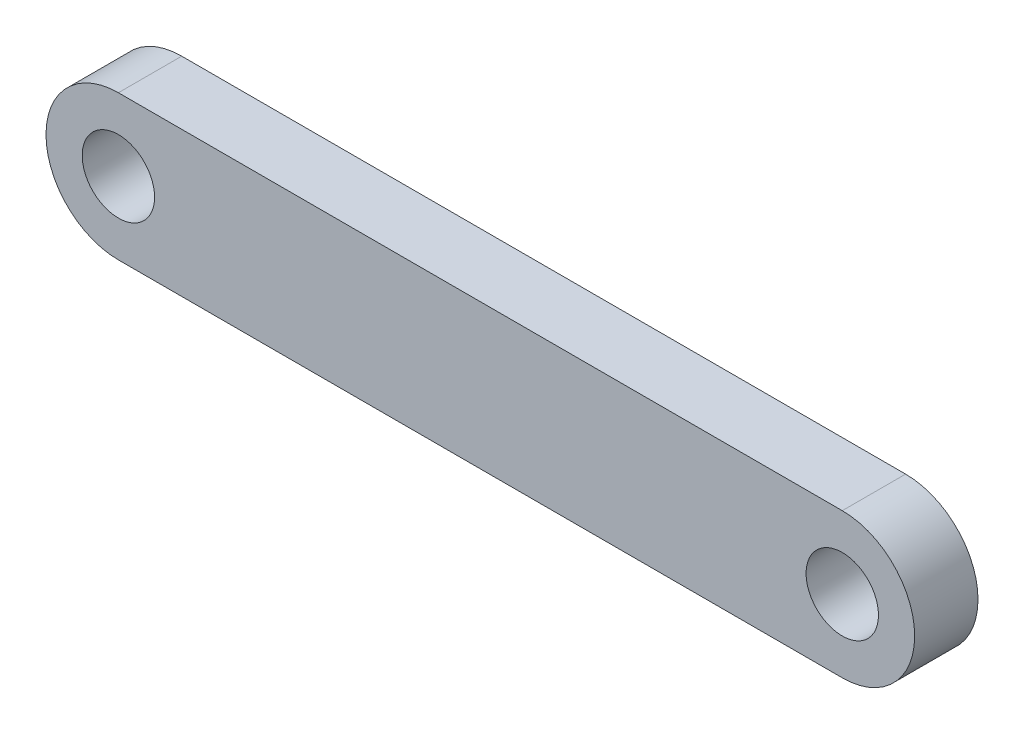
ISO-10303-21;
HEADER;
FILE_DESCRIPTION(('STEP AP214'),'2;1');
FILE_NAME('part.step','',(''),(''),'','','');
FILE_SCHEMA(('AUTOMOTIVE_DESIGN { 1 0 10303 214 1 1 1 1 }'));
ENDSEC;
DATA;
#1=APPLICATION_CONTEXT('core data for automotive mechanical design processes');
#2=APPLICATION_PROTOCOL_DEFINITION('international standard','automotive_design',2000,#1);
#3=PRODUCT_CONTEXT('',#1,'mechanical');
#4=PRODUCT('Part','Part','',(#3));
#5=PRODUCT_RELATED_PRODUCT_CATEGORY('part','',(#4));
#6=PRODUCT_DEFINITION_FORMATION('','',#4);
#7=PRODUCT_DEFINITION_CONTEXT('part definition',#1,'design');
#8=PRODUCT_DEFINITION('design','',#6,#7);
#9=PRODUCT_DEFINITION_SHAPE('','',#8);
#10=(LENGTH_UNIT() NAMED_UNIT(*) SI_UNIT(.MILLI.,.METRE.));
#11=(NAMED_UNIT(*) PLANE_ANGLE_UNIT() SI_UNIT($,.RADIAN.));
#12=(NAMED_UNIT(*) SI_UNIT($,.STERADIAN.) SOLID_ANGLE_UNIT());
#13=UNCERTAINTY_MEASURE_WITH_UNIT(LENGTH_MEASURE(1.E-05),#10,'distance_accuracy_value','');
#14=(GEOMETRIC_REPRESENTATION_CONTEXT(3) GLOBAL_UNCERTAINTY_ASSIGNED_CONTEXT((#13)) GLOBAL_UNIT_ASSIGNED_CONTEXT((#10,
#11,#12)) REPRESENTATION_CONTEXT('',''));
#15=CARTESIAN_POINT('',(0.,0.,0.));
#16=DIRECTION('',(0.,0.,1.));
#17=DIRECTION('',(1.,0.,0.));
#18=AXIS2_PLACEMENT_3D('',#15,#16,#17);
#19=CARTESIAN_POINT('',(0.,0.,8.75));
#20=DIRECTION('',(0.,0.,1.));
#21=DIRECTION('',(1.,0.,0.));
#22=AXIS2_PLACEMENT_3D('',#19,#20,#21);
#23=PLANE('',#22);
#24=CARTESIAN_POINT('',(0.,0.,8.75));
#25=DIRECTION('',(0.,0.,1.));
#26=DIRECTION('',(1.,0.,0.));
#27=AXIS2_PLACEMENT_3D('',#24,#25,#26);
#28=CIRCLE('',#27,5.);
#29=CARTESIAN_POINT('',(5.,0.,8.75));
#30=VERTEX_POINT('',#29);
#31=EDGE_CURVE('E104',#30,#30,#28,.T.);
#32=ORIENTED_EDGE('',*,*,#31,.F.);
#33=EDGE_LOOP('',(#32));
#34=FACE_BOUND('',#33,.T.);
#35=CARTESIAN_POINT('',(0.,0.,8.75));
#36=DIRECTION('',(0.,0.,1.));
#37=DIRECTION('',(1.,0.,0.));
#38=AXIS2_PLACEMENT_3D('',#35,#36,#37);
#39=CIRCLE('',#38,10.);
#40=CARTESIAN_POINT('',(0.,10.,8.75));
#41=VERTEX_POINT('',#40);
#42=CARTESIAN_POINT('',(0.,-10.,8.75));
#43=VERTEX_POINT('',#42);
#44=EDGE_CURVE('E89',#41,#43,#39,.T.);
#45=ORIENTED_EDGE('',*,*,#44,.T.);
#46=DIRECTION('',(1.,0.,0.));
#47=VECTOR('',#46,1.);
#48=CARTESIAN_POINT('',(0.,-10.,8.75));
#49=LINE('',#48,#47);
#50=CARTESIAN_POINT('',(100.,-10.,8.75));
#51=VERTEX_POINT('',#50);
#52=EDGE_CURVE('E84',#43,#51,#49,.T.);
#53=ORIENTED_EDGE('',*,*,#52,.T.);
#54=CARTESIAN_POINT('',(100.,0.,8.75));
#55=DIRECTION('',(0.,0.,1.));
#56=DIRECTION('',(1.,0.,0.));
#57=AXIS2_PLACEMENT_3D('',#54,#55,#56);
#58=CIRCLE('',#57,10.);
#59=CARTESIAN_POINT('',(100.,10.,8.75));
#60=VERTEX_POINT('',#59);
#61=EDGE_CURVE('E87',#51,#60,#58,.T.);
#62=ORIENTED_EDGE('',*,*,#61,.T.);
#63=DIRECTION('',(-1.,0.,0.));
#64=VECTOR('',#63,1.);
#65=CARTESIAN_POINT('',(0.,10.,8.75));
#66=LINE('',#65,#64);
#67=EDGE_CURVE('E54',#60,#41,#66,.T.);
#68=ORIENTED_EDGE('',*,*,#67,.T.);
#69=EDGE_LOOP('',(#45,#53,#62,#68));
#70=FACE_BOUND('',#69,.T.);
#71=CARTESIAN_POINT('',(100.,0.,8.75));
#72=DIRECTION('',(0.,0.,1.));
#73=DIRECTION('',(1.,0.,0.));
#74=AXIS2_PLACEMENT_3D('',#71,#72,#73);
#75=CIRCLE('',#74,4.99999999999999);
#76=CARTESIAN_POINT('',(105.,0.,8.75));
#77=VERTEX_POINT('',#76);
#78=EDGE_CURVE('E119',#77,#77,#75,.T.);
#79=ORIENTED_EDGE('',*,*,#78,.F.);
#80=EDGE_LOOP('',(#79));
#81=FACE_BOUND('',#80,.T.);
#82=ADVANCED_FACE('F37',(#34,#70,#81),#23,.T.);
#83=CARTESIAN_POINT('',(0.,0.,0.));
#84=DIRECTION('',(0.,0.,1.));
#85=DIRECTION('',(1.,0.,0.));
#86=AXIS2_PLACEMENT_3D('',#83,#84,#85);
#87=PLANE('',#86);
#88=CARTESIAN_POINT('',(0.,0.,0.));
#89=DIRECTION('',(0.,0.,1.));
#90=DIRECTION('',(1.,0.,0.));
#91=AXIS2_PLACEMENT_3D('',#88,#89,#90);
#92=CIRCLE('',#91,10.);
#93=CARTESIAN_POINT('',(0.,10.,0.));
#94=VERTEX_POINT('',#93);
#95=CARTESIAN_POINT('',(0.,-10.,0.));
#96=VERTEX_POINT('',#95);
#97=EDGE_CURVE('E101',#94,#96,#92,.T.);
#98=ORIENTED_EDGE('',*,*,#97,.F.);
#99=DIRECTION('',(-1.,0.,0.));
#100=VECTOR('',#99,1.);
#101=CARTESIAN_POINT('',(0.,10.,0.));
#102=LINE('',#101,#100);
#103=CARTESIAN_POINT('',(100.,10.,0.));
#104=VERTEX_POINT('',#103);
#105=EDGE_CURVE('E77',#104,#94,#102,.T.);
#106=ORIENTED_EDGE('',*,*,#105,.F.);
#107=CARTESIAN_POINT('',(100.,0.,0.));
#108=DIRECTION('',(0.,0.,1.));
#109=DIRECTION('',(1.,0.,0.));
#110=AXIS2_PLACEMENT_3D('',#107,#108,#109);
#111=CIRCLE('',#110,10.);
#112=CARTESIAN_POINT('',(100.,-10.,0.));
#113=VERTEX_POINT('',#112);
#114=EDGE_CURVE('E71',#113,#104,#111,.T.);
#115=ORIENTED_EDGE('',*,*,#114,.F.);
#116=DIRECTION('',(1.,0.,0.));
#117=VECTOR('',#116,1.);
#118=CARTESIAN_POINT('',(0.,-10.,0.));
#119=LINE('',#118,#117);
#120=EDGE_CURVE('E93',#96,#113,#119,.T.);
#121=ORIENTED_EDGE('',*,*,#120,.F.);
#122=EDGE_LOOP('',(#98,#106,#115,#121));
#123=FACE_BOUND('',#122,.T.);
#124=CARTESIAN_POINT('',(0.,0.,0.));
#125=DIRECTION('',(0.,0.,1.));
#126=DIRECTION('',(1.,0.,0.));
#127=AXIS2_PLACEMENT_3D('',#124,#125,#126);
#128=CIRCLE('',#127,5.);
#129=CARTESIAN_POINT('',(5.,0.,0.));
#130=VERTEX_POINT('',#129);
#131=EDGE_CURVE('E116',#130,#130,#128,.T.);
#132=ORIENTED_EDGE('',*,*,#131,.T.);
#133=EDGE_LOOP('',(#132));
#134=FACE_BOUND('',#133,.T.);
#135=CARTESIAN_POINT('',(100.,0.,0.));
#136=DIRECTION('',(0.,0.,1.));
#137=DIRECTION('',(1.,0.,0.));
#138=AXIS2_PLACEMENT_3D('',#135,#136,#137);
#139=CIRCLE('',#138,4.99999999999999);
#140=CARTESIAN_POINT('',(105.,0.,0.));
#141=VERTEX_POINT('',#140);
#142=EDGE_CURVE('E122',#141,#141,#139,.T.);
#143=ORIENTED_EDGE('',*,*,#142,.T.);
#144=EDGE_LOOP('',(#143));
#145=FACE_BOUND('',#144,.T.);
#146=ADVANCED_FACE('F112',(#123,#134,#145),#87,.F.);
#147=CARTESIAN_POINT('',(0.,0.,8.75));
#148=DIRECTION('',(0.,0.,-1.));
#149=DIRECTION('',(-1.,0.,0.));
#150=AXIS2_PLACEMENT_3D('',#147,#148,#149);
#151=CYLINDRICAL_SURFACE('',#150,10.);
#152=ORIENTED_EDGE('',*,*,#97,.T.);
#153=DIRECTION('',(0.,0.,-1.));
#154=VECTOR('',#153,1.);
#155=CARTESIAN_POINT('',(0.,-10.,8.75));
#156=LINE('',#155,#154);
#157=EDGE_CURVE('E11',#43,#96,#156,.T.);
#158=ORIENTED_EDGE('',*,*,#157,.F.);
#159=ORIENTED_EDGE('',*,*,#44,.F.);
#160=DIRECTION('',(0.,0.,-1.));
#161=VECTOR('',#160,1.);
#162=CARTESIAN_POINT('',(0.,10.,8.75));
#163=LINE('',#162,#161);
#164=EDGE_CURVE('E97',#41,#94,#163,.T.);
#165=ORIENTED_EDGE('',*,*,#164,.T.);
#166=EDGE_LOOP('',(#152,#158,#159,#165));
#167=FACE_BOUND('',#166,.T.);
#168=ADVANCED_FACE('F39',(#167),#151,.T.);
#169=CARTESIAN_POINT('',(0.,-10.,8.75));
#170=DIRECTION('',(0.,1.,0.));
#171=DIRECTION('',(0.,0.,1.));
#172=AXIS2_PLACEMENT_3D('',#169,#170,#171);
#173=PLANE('',#172);
#174=ORIENTED_EDGE('',*,*,#120,.T.);
#175=DIRECTION('',(0.,0.,-1.));
#176=VECTOR('',#175,1.);
#177=CARTESIAN_POINT('',(100.,-10.,8.75));
#178=LINE('',#177,#176);
#179=EDGE_CURVE('E46',#51,#113,#178,.T.);
#180=ORIENTED_EDGE('',*,*,#179,.F.);
#181=ORIENTED_EDGE('',*,*,#52,.F.);
#182=ORIENTED_EDGE('',*,*,#157,.T.);
#183=EDGE_LOOP('',(#174,#180,#181,#182));
#184=FACE_BOUND('',#183,.T.);
#185=ADVANCED_FACE('F92',(#184),#173,.F.);
#186=CARTESIAN_POINT('',(100.,0.,8.75));
#187=DIRECTION('',(0.,0.,-1.));
#188=DIRECTION('',(-1.,0.,0.));
#189=AXIS2_PLACEMENT_3D('',#186,#187,#188);
#190=CYLINDRICAL_SURFACE('',#189,10.);
#191=ORIENTED_EDGE('',*,*,#114,.T.);
#192=DIRECTION('',(0.,0.,-1.));
#193=VECTOR('',#192,1.);
#194=CARTESIAN_POINT('',(100.,10.,8.75));
#195=LINE('',#194,#193);
#196=EDGE_CURVE('E94',#60,#104,#195,.T.);
#197=ORIENTED_EDGE('',*,*,#196,.F.);
#198=ORIENTED_EDGE('',*,*,#61,.F.);
#199=ORIENTED_EDGE('',*,*,#179,.T.);
#200=EDGE_LOOP('',(#191,#197,#198,#199));
#201=FACE_BOUND('',#200,.T.);
#202=ADVANCED_FACE('F95',(#201),#190,.T.);
#203=CARTESIAN_POINT('',(0.,10.,8.75));
#204=DIRECTION('',(0.,-1.,0.));
#205=DIRECTION('',(0.,0.,-1.));
#206=AXIS2_PLACEMENT_3D('',#203,#204,#205);
#207=PLANE('',#206);
#208=ORIENTED_EDGE('',*,*,#105,.T.);
#209=ORIENTED_EDGE('',*,*,#164,.F.);
#210=ORIENTED_EDGE('',*,*,#67,.F.);
#211=ORIENTED_EDGE('',*,*,#196,.T.);
#212=EDGE_LOOP('',(#208,#209,#210,#211));
#213=FACE_BOUND('',#212,.T.);
#214=ADVANCED_FACE('F109',(#213),#207,.F.);
#215=CARTESIAN_POINT('',(0.,0.,8.75));
#216=DIRECTION('',(0.,0.,-1.));
#217=DIRECTION('',(-1.,0.,0.));
#218=AXIS2_PLACEMENT_3D('',#215,#216,#217);
#219=CYLINDRICAL_SURFACE('',#218,5.);
#220=ORIENTED_EDGE('',*,*,#31,.T.);
#221=EDGE_LOOP('',(#220));
#222=FACE_BOUND('',#221,.T.);
#223=ORIENTED_EDGE('',*,*,#131,.F.);
#224=EDGE_LOOP('',(#223));
#225=FACE_BOUND('',#224,.T.);
#226=ADVANCED_FACE('F139',(#222,#225),#219,.F.);
#227=CARTESIAN_POINT('',(100.,0.,8.75));
#228=DIRECTION('',(0.,0.,-1.));
#229=DIRECTION('',(-1.,0.,0.));
#230=AXIS2_PLACEMENT_3D('',#227,#228,#229);
#231=CYLINDRICAL_SURFACE('',#230,4.99999999999999);
#232=ORIENTED_EDGE('',*,*,#78,.T.);
#233=EDGE_LOOP('',(#232));
#234=FACE_BOUND('',#233,.T.);
#235=ORIENTED_EDGE('',*,*,#142,.F.);
#236=EDGE_LOOP('',(#235));
#237=FACE_BOUND('',#236,.T.);
#238=ADVANCED_FACE('F128',(#234,#237),#231,.F.);
#239=CLOSED_SHELL('',(#82,#146,#168,#185,#202,#214,#226,#238));
#240=MANIFOLD_SOLID_BREP('B2',#239);
#241=ADVANCED_BREP_SHAPE_REPRESENTATION('',(#18,#240),#14);
#242=SHAPE_DEFINITION_REPRESENTATION(#9,#241);
ENDSEC;
END-ISO-10303-21;
